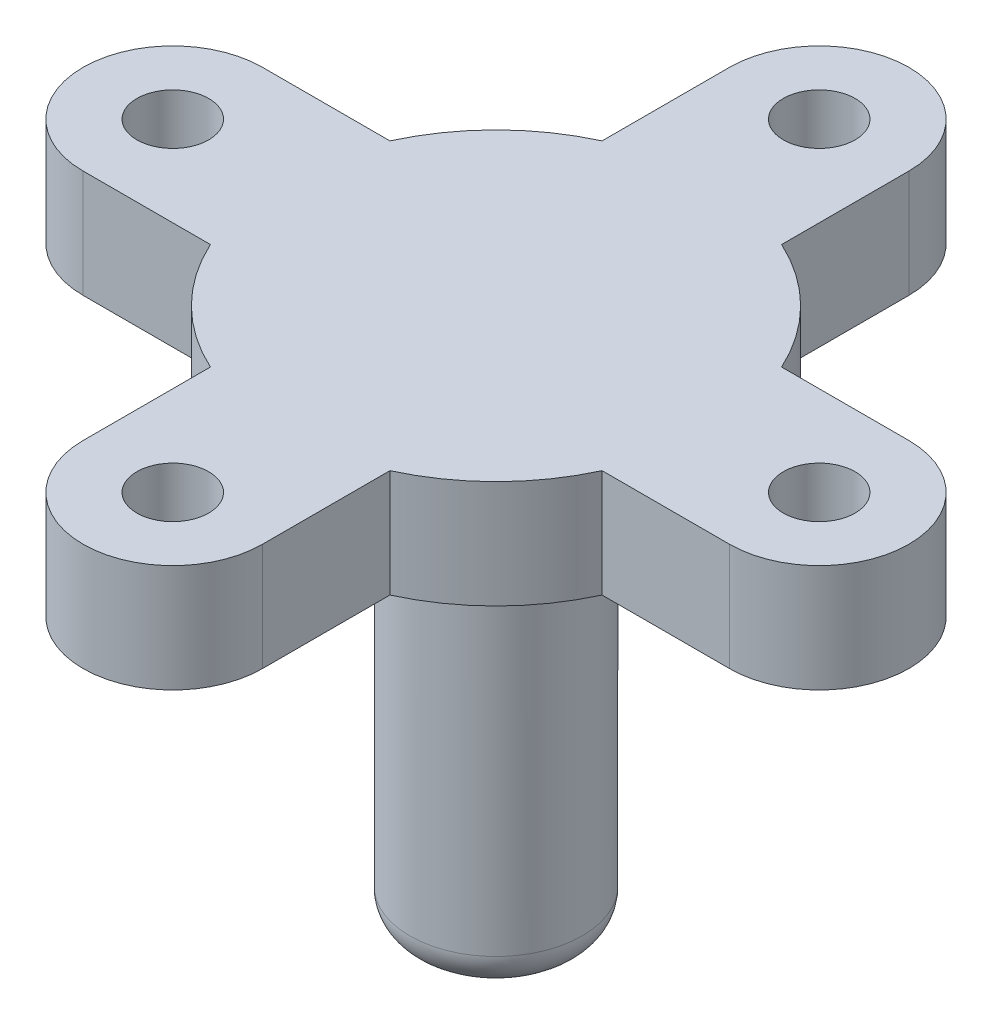
ISO-10303-21;
HEADER;
FILE_DESCRIPTION(('STEP AP214'),'2;1');
FILE_NAME('part.step','',(''),(''),'','','');
FILE_SCHEMA(('AUTOMOTIVE_DESIGN { 1 0 10303 214 1 1 1 1 }'));
ENDSEC;
DATA;
#1=APPLICATION_CONTEXT('core data for automotive mechanical design processes');
#2=APPLICATION_PROTOCOL_DEFINITION('international standard','automotive_design',2000,#1);
#3=PRODUCT_CONTEXT('',#1,'mechanical');
#4=PRODUCT('Part','Part','',(#3));
#5=PRODUCT_RELATED_PRODUCT_CATEGORY('part','',(#4));
#6=PRODUCT_DEFINITION_FORMATION('','',#4);
#7=PRODUCT_DEFINITION_CONTEXT('part definition',#1,'design');
#8=PRODUCT_DEFINITION('design','',#6,#7);
#9=PRODUCT_DEFINITION_SHAPE('','',#8);
#10=(LENGTH_UNIT() NAMED_UNIT(*) SI_UNIT(.MILLI.,.METRE.));
#11=(NAMED_UNIT(*) PLANE_ANGLE_UNIT() SI_UNIT($,.RADIAN.));
#12=(NAMED_UNIT(*) SI_UNIT($,.STERADIAN.) SOLID_ANGLE_UNIT());
#13=UNCERTAINTY_MEASURE_WITH_UNIT(LENGTH_MEASURE(1.E-05),#10,'distance_accuracy_value','');
#14=(GEOMETRIC_REPRESENTATION_CONTEXT(3) GLOBAL_UNCERTAINTY_ASSIGNED_CONTEXT((#13)) GLOBAL_UNIT_ASSIGNED_CONTEXT((#10,
#11,#12)) REPRESENTATION_CONTEXT('',''));
#15=CARTESIAN_POINT('',(0.,0.,0.));
#16=DIRECTION('',(0.,0.,1.));
#17=DIRECTION('',(1.,0.,0.));
#18=AXIS2_PLACEMENT_3D('',#15,#16,#17);
#19=CARTESIAN_POINT('',(-6.41572323944757E-08,0.645548318898728,-27.0067944363537));
#20=DIRECTION('',(0.,1.,0.));
#21=DIRECTION('',(0.,0.,1.));
#22=AXIS2_PLACEMENT_3D('',#19,#20,#21);
#23=PLANE('',#22);
#24=CARTESIAN_POINT('',(-6.4156797474945E-08,0.645548318898728,27.0067945127373));
#25=DIRECTION('',(0.,1.,0.));
#26=DIRECTION('',(0.,0.,1.));
#27=AXIS2_PLACEMENT_3D('',#24,#25,#26);
#28=CIRCLE('',#27,2.99999999999995);
#29=CARTESIAN_POINT('',(-6.4156797474945E-08,0.645548318898728,30.0067945127373));
#30=VERTEX_POINT('',#29);
#31=EDGE_CURVE('E482',#30,#30,#28,.T.);
#32=ORIENTED_EDGE('',*,*,#31,.F.);
#33=EDGE_LOOP('',(#32));
#34=FACE_BOUND('',#33,.T.);
#35=CARTESIAN_POINT('',(-6.41572323944757E-08,0.645548318898728,-27.0067944363537));
#36=DIRECTION('',(0.,1.,0.));
#37=DIRECTION('',(0.,0.,1.));
#38=AXIS2_PLACEMENT_3D('',#35,#36,#37);
#39=CIRCLE('',#38,3.);
#40=CARTESIAN_POINT('',(-6.41572323944757E-08,0.645548318898728,-24.0067944363537));
#41=VERTEX_POINT('',#40);
#42=EDGE_CURVE('E201',#41,#41,#39,.T.);
#43=ORIENTED_EDGE('',*,*,#42,.F.);
#44=EDGE_LOOP('',(#43));
#45=FACE_BOUND('',#44,.T.);
#46=CARTESIAN_POINT('',(-6.41572323944757E-08,0.645548318898728,-27.0067944363537));
#47=DIRECTION('',(0.,1.,0.));
#48=DIRECTION('',(0.,0.,1.));
#49=AXIS2_PLACEMENT_3D('',#46,#47,#48);
#50=CIRCLE('',#49,7.50000153882916);
#51=CARTESIAN_POINT('',(7.49999993584185,0.645548318898728,-27.0067944363537));
#52=VERTEX_POINT('',#51);
#53=CARTESIAN_POINT('',(-7.50000006415815,0.645548318898728,-26.9999999618077));
#54=VERTEX_POINT('',#53);
#55=EDGE_CURVE('E243',#52,#54,#50,.T.);
#56=ORIENTED_EDGE('',*,*,#55,.T.);
#57=DIRECTION('',(0.,0.,1.));
#58=VECTOR('',#57,1.);
#59=CARTESIAN_POINT('',(-7.50000006415815,0.645548318898728,-26.9999999618077));
#60=LINE('',#59,#58);
#61=CARTESIAN_POINT('',(-7.50000006415784,0.645548318898728,-16.3630681337615));
#62=VERTEX_POINT('',#61);
#63=EDGE_CURVE('E131',#54,#62,#60,.T.);
#64=ORIENTED_EDGE('',*,*,#63,.T.);
#65=CARTESIAN_POINT('',(-6.41570165883996E-08,0.645548318898728,3.81918008637733E-08));
#66=DIRECTION('',(0.,1.,0.));
#67=DIRECTION('',(0.,0.,1.));
#68=AXIS2_PLACEMENT_3D('',#65,#66,#67);
#69=CIRCLE('',#68,18.0000000000001);
#70=CARTESIAN_POINT('',(-16.3630682361112,0.645548318898728,-7.49999996180729));
#71=VERTEX_POINT('',#70);
#72=EDGE_CURVE('E407',#62,#71,#69,.T.);
#73=ORIENTED_EDGE('',*,*,#72,.T.);
#74=DIRECTION('',(-1.,0.,0.));
#75=VECTOR('',#74,1.);
#76=CARTESIAN_POINT('',(-27.0067945387026,0.645548318898728,-7.49999996180706));
#77=LINE('',#76,#75);
#78=CARTESIAN_POINT('',(-27.0067945387026,0.645548318898728,-7.50000150063715));
#79=VERTEX_POINT('',#78);
#80=EDGE_CURVE('E410',#71,#79,#77,.T.);
#81=ORIENTED_EDGE('',*,*,#80,.T.);
#82=CARTESIAN_POINT('',(-27.0067945387026,0.645548318898728,3.81920150161602E-08));
#83=DIRECTION('',(0.,1.,0.));
#84=DIRECTION('',(0.,0.,1.));
#85=AXIS2_PLACEMENT_3D('',#82,#83,#84);
#86=CIRCLE('',#85,7.50000153882916);
#87=CARTESIAN_POINT('',(-27.0000000641565,0.645548318898728,7.50000003819294));
#88=VERTEX_POINT('',#87);
#89=EDGE_CURVE('E414',#79,#88,#86,.T.);
#90=ORIENTED_EDGE('',*,*,#89,.T.);
#91=DIRECTION('',(1.,0.,0.));
#92=VECTOR('',#91,1.);
#93=CARTESIAN_POINT('',(-27.0000000641565,0.645548318898728,7.50000003819294));
#94=LINE('',#93,#92);
#95=CARTESIAN_POINT('',(-16.3630682361105,0.645548318898728,7.50000003819273));
#96=VERTEX_POINT('',#95);
#97=EDGE_CURVE('E421',#88,#96,#94,.T.);
#98=ORIENTED_EDGE('',*,*,#97,.T.);
#99=CARTESIAN_POINT('',(-6.41570165883996E-08,0.645548318898728,3.81918008637733E-08));
#100=DIRECTION('',(0.,1.,0.));
#101=DIRECTION('',(0.,0.,1.));
#102=AXIS2_PLACEMENT_3D('',#99,#100,#101);
#103=CIRCLE('',#102,18.0000000000003);
#104=CARTESIAN_POINT('',(-7.50000006415636,0.645548318898728,16.3630682101461));
#105=VERTEX_POINT('',#104);
#106=EDGE_CURVE('E424',#96,#105,#103,.T.);
#107=ORIENTED_EDGE('',*,*,#106,.T.);
#108=DIRECTION('',(0.,0.,1.));
#109=VECTOR('',#108,1.);
#110=CARTESIAN_POINT('',(-7.50000006415588,0.645548318898728,27.0067945127373));
#111=LINE('',#110,#109);
#112=CARTESIAN_POINT('',(-7.50000160298596,0.645548318898728,27.0067945127373));
#113=VERTEX_POINT('',#112);
#114=EDGE_CURVE('E427',#105,#113,#111,.T.);
#115=ORIENTED_EDGE('',*,*,#114,.T.);
#116=CARTESIAN_POINT('',(-6.4156797474945E-08,0.645548318898728,27.0067945127373));
#117=DIRECTION('',(0.,1.,0.));
#118=DIRECTION('',(0.,0.,1.));
#119=AXIS2_PLACEMENT_3D('',#116,#117,#118);
#120=CIRCLE('',#119,7.50000153882917);
#121=CARTESIAN_POINT('',(7.49999993584412,0.645548318898728,27.0000000381913));
#122=VERTEX_POINT('',#121);
#123=EDGE_CURVE('E430',#113,#122,#120,.T.);
#124=ORIENTED_EDGE('',*,*,#123,.T.);
#125=DIRECTION('',(0.,0.,-1.));
#126=VECTOR('',#125,1.);
#127=CARTESIAN_POINT('',(7.49999993584412,0.645548318898728,27.0000000381913));
#128=LINE('',#127,#126);
#129=CARTESIAN_POINT('',(7.49999993584362,0.645548318898728,16.3630682101454));
#130=VERTEX_POINT('',#129);
#131=EDGE_CURVE('E433',#122,#130,#128,.T.);
#132=ORIENTED_EDGE('',*,*,#131,.T.);
#133=CARTESIAN_POINT('',(-6.41570165883996E-08,0.645548318898728,3.81918008637733E-08));
#134=DIRECTION('',(0.,1.,0.));
#135=DIRECTION('',(0.,0.,1.));
#136=AXIS2_PLACEMENT_3D('',#133,#134,#135);
#137=CIRCLE('',#136,18.0000000000002);
#138=CARTESIAN_POINT('',(16.363068107797,0.645548318898728,7.50000003819127));
#139=VERTEX_POINT('',#138);
#140=EDGE_CURVE('E436',#130,#139,#137,.T.);
#141=ORIENTED_EDGE('',*,*,#140,.T.);
#142=DIRECTION('',(1.,0.,0.));
#143=VECTOR('',#142,1.);
#144=CARTESIAN_POINT('',(27.0067944103885,0.645548318898728,7.50000003819067));
#145=LINE('',#144,#143);
#146=CARTESIAN_POINT('',(27.0067944103885,0.645548318898728,7.50000157702075));
#147=VERTEX_POINT('',#146);
#148=EDGE_CURVE('E439',#139,#147,#145,.T.);
#149=ORIENTED_EDGE('',*,*,#148,.T.);
#150=CARTESIAN_POINT('',(27.0067944103885,0.645548318898728,3.8191583404008E-08));
#151=DIRECTION('',(0.,1.,0.));
#152=DIRECTION('',(0.,0.,1.));
#153=AXIS2_PLACEMENT_3D('',#150,#151,#152);
#154=CIRCLE('',#153,7.50000153882916);
#155=CARTESIAN_POINT('',(26.9999999358425,0.645548318898728,-7.49999996180933));
#156=VERTEX_POINT('',#155);
#157=EDGE_CURVE('E174',#147,#156,#154,.T.);
#158=ORIENTED_EDGE('',*,*,#157,.T.);
#159=DIRECTION('',(-1.,0.,0.));
#160=VECTOR('',#159,1.);
#161=CARTESIAN_POINT('',(26.9999999358425,0.645548318898728,-7.49999996180933));
#162=LINE('',#161,#160);
#163=CARTESIAN_POINT('',(16.3630681077963,0.645548318898728,-7.49999996180873));
#164=VERTEX_POINT('',#163);
#165=EDGE_CURVE('E168',#156,#164,#162,.T.);
#166=ORIENTED_EDGE('',*,*,#165,.T.);
#167=CARTESIAN_POINT('',(-6.41570165883996E-08,0.645548318898728,3.81918008637733E-08));
#168=DIRECTION('',(0.,1.,0.));
#169=DIRECTION('',(0.,0.,1.));
#170=AXIS2_PLACEMENT_3D('',#167,#168,#169);
#171=CIRCLE('',#170,18.);
#172=CARTESIAN_POINT('',(7.4999999358422,0.645548318898728,-16.3630681337621));
#173=VERTEX_POINT('',#172);
#174=EDGE_CURVE('E172',#164,#173,#171,.T.);
#175=ORIENTED_EDGE('',*,*,#174,.T.);
#176=DIRECTION('',(0.,0.,-1.));
#177=VECTOR('',#176,1.);
#178=CARTESIAN_POINT('',(7.49999993584185,0.645548318898728,-27.0067944363537));
#179=LINE('',#178,#177);
#180=EDGE_CURVE('E63',#173,#52,#179,.T.);
#181=ORIENTED_EDGE('',*,*,#180,.T.);
#182=EDGE_LOOP('',(#56,#64,#73,#81,#90,#98,#107,#115,#124,#132,#141,#149,#158,#166,#175,#181));
#183=FACE_BOUND('',#182,.T.);
#184=CARTESIAN_POINT('',(27.0067944103885,0.645548318898728,3.8191583404008E-08));
#185=DIRECTION('',(0.,1.,0.));
#186=DIRECTION('',(0.,0.,1.));
#187=AXIS2_PLACEMENT_3D('',#184,#185,#186);
#188=CIRCLE('',#187,3.);
#189=CARTESIAN_POINT('',(27.0067944103885,0.645548318898728,3.00000003819159));
#190=VERTEX_POINT('',#189);
#191=EDGE_CURVE('E474',#190,#190,#188,.T.);
#192=ORIENTED_EDGE('',*,*,#191,.F.);
#193=EDGE_LOOP('',(#192));
#194=FACE_BOUND('',#193,.T.);
#195=CARTESIAN_POINT('',(-27.0067945387026,0.645548318898728,3.81920150161602E-08));
#196=DIRECTION('',(0.,1.,0.));
#197=DIRECTION('',(0.,0.,1.));
#198=AXIS2_PLACEMENT_3D('',#195,#196,#197);
#199=CIRCLE('',#198,3.);
#200=CARTESIAN_POINT('',(-27.0067945387026,0.645548318898728,3.00000003819202));
#201=VERTEX_POINT('',#200);
#202=EDGE_CURVE('E490',#201,#201,#199,.T.);
#203=ORIENTED_EDGE('',*,*,#202,.F.);
#204=EDGE_LOOP('',(#203));
#205=FACE_BOUND('',#204,.T.);
#206=ADVANCED_FACE('F45',(#34,#45,#183,#194,#205),#23,.T.);
#207=CARTESIAN_POINT('',(-6.41572323944757E-08,-8.35445168110127,-27.0067944363537));
#208=DIRECTION('',(0.,1.,0.));
#209=DIRECTION('',(0.,0.,1.));
#210=AXIS2_PLACEMENT_3D('',#207,#208,#209);
#211=PLANE('',#210);
#212=CARTESIAN_POINT('',(-6.41570165883996E-08,-8.35445168110127,3.81918008637733E-08));
#213=DIRECTION('',(0.,1.,0.));
#214=DIRECTION('',(0.,0.,1.));
#215=AXIS2_PLACEMENT_3D('',#212,#213,#214);
#216=CIRCLE('',#215,10.2);
#217=CARTESIAN_POINT('',(-6.41570165883996E-08,-8.35445168110127,10.2000000381918));
#218=VERTEX_POINT('',#217);
#219=EDGE_CURVE('E11',#218,#218,#216,.T.);
#220=ORIENTED_EDGE('',*,*,#219,.T.);
#221=EDGE_LOOP('',(#220));
#222=FACE_BOUND('',#221,.T.);
#223=CARTESIAN_POINT('',(-6.41572323944757E-08,-8.35445168110127,-27.0067944363537));
#224=DIRECTION('',(0.,1.,0.));
#225=DIRECTION('',(0.,0.,1.));
#226=AXIS2_PLACEMENT_3D('',#223,#224,#225);
#227=CIRCLE('',#226,7.50000153882916);
#228=CARTESIAN_POINT('',(7.49999993584185,-8.35445168110127,-27.0067944363537));
#229=VERTEX_POINT('',#228);
#230=CARTESIAN_POINT('',(-7.50000006415815,-8.35445168110127,-26.9999999618077));
#231=VERTEX_POINT('',#230);
#232=EDGE_CURVE('E196',#229,#231,#227,.T.);
#233=ORIENTED_EDGE('',*,*,#232,.F.);
#234=DIRECTION('',(0.,0.,-1.));
#235=VECTOR('',#234,1.);
#236=CARTESIAN_POINT('',(7.49999993584185,-8.35445168110127,-27.0067944363537));
#237=LINE('',#236,#235);
#238=CARTESIAN_POINT('',(7.4999999358422,-8.35445168110127,-16.3630681337621));
#239=VERTEX_POINT('',#238);
#240=EDGE_CURVE('E122',#239,#229,#237,.T.);
#241=ORIENTED_EDGE('',*,*,#240,.F.);
#242=CARTESIAN_POINT('',(-6.41570165883996E-08,-8.35445168110127,3.81918008637733E-08));
#243=DIRECTION('',(0.,1.,0.));
#244=DIRECTION('',(0.,0.,1.));
#245=AXIS2_PLACEMENT_3D('',#242,#243,#244);
#246=CIRCLE('',#245,18.);
#247=CARTESIAN_POINT('',(16.3630681077963,-8.35445168110127,-7.49999996180873));
#248=VERTEX_POINT('',#247);
#249=EDGE_CURVE('E116',#248,#239,#246,.T.);
#250=ORIENTED_EDGE('',*,*,#249,.F.);
#251=DIRECTION('',(-1.,0.,0.));
#252=VECTOR('',#251,1.);
#253=CARTESIAN_POINT('',(26.9999999358425,-8.35445168110127,-7.49999996180933));
#254=LINE('',#253,#252);
#255=CARTESIAN_POINT('',(26.9999999358425,-8.35445168110127,-7.49999996180933));
#256=VERTEX_POINT('',#255);
#257=EDGE_CURVE('E183',#256,#248,#254,.T.);
#258=ORIENTED_EDGE('',*,*,#257,.F.);
#259=CARTESIAN_POINT('',(27.0067944103885,-8.35445168110127,3.8191583404008E-08));
#260=DIRECTION('',(0.,1.,0.));
#261=DIRECTION('',(0.,0.,1.));
#262=AXIS2_PLACEMENT_3D('',#259,#260,#261);
#263=CIRCLE('',#262,7.50000153882916);
#264=CARTESIAN_POINT('',(27.0067944103885,-8.35445168110127,7.50000157702075));
#265=VERTEX_POINT('',#264);
#266=EDGE_CURVE('E234',#265,#256,#263,.T.);
#267=ORIENTED_EDGE('',*,*,#266,.F.);
#268=DIRECTION('',(1.,0.,0.));
#269=VECTOR('',#268,1.);
#270=CARTESIAN_POINT('',(27.0067944103885,-8.35445168110127,7.50000003819067));
#271=LINE('',#270,#269);
#272=CARTESIAN_POINT('',(16.363068107797,-8.35445168110127,7.50000003819127));
#273=VERTEX_POINT('',#272);
#274=EDGE_CURVE('E231',#273,#265,#271,.T.);
#275=ORIENTED_EDGE('',*,*,#274,.F.);
#276=CARTESIAN_POINT('',(-6.41570165883996E-08,-8.35445168110127,3.81918008637733E-08));
#277=DIRECTION('',(0.,1.,0.));
#278=DIRECTION('',(0.,0.,1.));
#279=AXIS2_PLACEMENT_3D('',#276,#277,#278);
#280=CIRCLE('',#279,18.0000000000002);
#281=CARTESIAN_POINT('',(7.49999993584362,-8.35445168110127,16.3630682101454));
#282=VERTEX_POINT('',#281);
#283=EDGE_CURVE('E228',#282,#273,#280,.T.);
#284=ORIENTED_EDGE('',*,*,#283,.F.);
#285=DIRECTION('',(0.,0.,-1.));
#286=VECTOR('',#285,1.);
#287=CARTESIAN_POINT('',(7.49999993584412,-8.35445168110127,27.0000000381913));
#288=LINE('',#287,#286);
#289=CARTESIAN_POINT('',(7.49999993584412,-8.35445168110127,27.0000000381913));
#290=VERTEX_POINT('',#289);
#291=EDGE_CURVE('E225',#290,#282,#288,.T.);
#292=ORIENTED_EDGE('',*,*,#291,.F.);
#293=CARTESIAN_POINT('',(-6.4156797474945E-08,-8.35445168110127,27.0067945127373));
#294=DIRECTION('',(0.,1.,0.));
#295=DIRECTION('',(0.,0.,1.));
#296=AXIS2_PLACEMENT_3D('',#293,#294,#295);
#297=CIRCLE('',#296,7.50000153882917);
#298=CARTESIAN_POINT('',(-7.50000160298596,-8.35445168110127,27.0067945127373));
#299=VERTEX_POINT('',#298);
#300=EDGE_CURVE('E222',#299,#290,#297,.T.);
#301=ORIENTED_EDGE('',*,*,#300,.F.);
#302=DIRECTION('',(0.,0.,1.));
#303=VECTOR('',#302,1.);
#304=CARTESIAN_POINT('',(-7.50000006415588,-8.35445168110127,27.0067945127373));
#305=LINE('',#304,#303);
#306=CARTESIAN_POINT('',(-7.50000006415636,-8.35445168110127,16.3630682101461));
#307=VERTEX_POINT('',#306);
#308=EDGE_CURVE('E219',#307,#299,#305,.T.);
#309=ORIENTED_EDGE('',*,*,#308,.F.);
#310=CARTESIAN_POINT('',(-6.41570165883996E-08,-8.35445168110127,3.81918008637733E-08));
#311=DIRECTION('',(0.,1.,0.));
#312=DIRECTION('',(0.,0.,1.));
#313=AXIS2_PLACEMENT_3D('',#310,#311,#312);
#314=CIRCLE('',#313,18.0000000000003);
#315=CARTESIAN_POINT('',(-16.3630682361105,-8.35445168110127,7.50000003819273));
#316=VERTEX_POINT('',#315);
#317=EDGE_CURVE('E216',#316,#307,#314,.T.);
#318=ORIENTED_EDGE('',*,*,#317,.F.);
#319=DIRECTION('',(1.,0.,0.));
#320=VECTOR('',#319,1.);
#321=CARTESIAN_POINT('',(-27.0000000641565,-8.35445168110127,7.50000003819294));
#322=LINE('',#321,#320);
#323=CARTESIAN_POINT('',(-27.0000000641565,-8.35445168110127,7.50000003819294));
#324=VERTEX_POINT('',#323);
#325=EDGE_CURVE('E213',#324,#316,#322,.T.);
#326=ORIENTED_EDGE('',*,*,#325,.F.);
#327=CARTESIAN_POINT('',(-27.0067945387026,-8.35445168110127,3.81920150161602E-08));
#328=DIRECTION('',(0.,1.,0.));
#329=DIRECTION('',(0.,0.,1.));
#330=AXIS2_PLACEMENT_3D('',#327,#328,#329);
#331=CIRCLE('',#330,7.50000153882916);
#332=CARTESIAN_POINT('',(-27.0067945387026,-8.35445168110127,-7.50000150063715));
#333=VERTEX_POINT('',#332);
#334=EDGE_CURVE('E210',#333,#324,#331,.T.);
#335=ORIENTED_EDGE('',*,*,#334,.F.);
#336=DIRECTION('',(-1.,0.,0.));
#337=VECTOR('',#336,1.);
#338=CARTESIAN_POINT('',(-27.0067945387026,-8.35445168110127,-7.49999996180706));
#339=LINE('',#338,#337);
#340=CARTESIAN_POINT('',(-16.3630682361112,-8.35445168110127,-7.49999996180729));
#341=VERTEX_POINT('',#340);
#342=EDGE_CURVE('E207',#341,#333,#339,.T.);
#343=ORIENTED_EDGE('',*,*,#342,.F.);
#344=CARTESIAN_POINT('',(-6.41570165883996E-08,-8.35445168110127,3.81918008637733E-08));
#345=DIRECTION('',(0.,1.,0.));
#346=DIRECTION('',(0.,0.,1.));
#347=AXIS2_PLACEMENT_3D('',#344,#345,#346);
#348=CIRCLE('',#347,18.0000000000001);
#349=CARTESIAN_POINT('',(-7.50000006415784,-8.35445168110127,-16.3630681337615));
#350=VERTEX_POINT('',#349);
#351=EDGE_CURVE('E204',#350,#341,#348,.T.);
#352=ORIENTED_EDGE('',*,*,#351,.F.);
#353=DIRECTION('',(0.,0.,1.));
#354=VECTOR('',#353,1.);
#355=CARTESIAN_POINT('',(-7.50000006415815,-8.35445168110127,-26.9999999618077));
#356=LINE('',#355,#354);
#357=EDGE_CURVE('E200',#231,#350,#356,.T.);
#358=ORIENTED_EDGE('',*,*,#357,.F.);
#359=EDGE_LOOP('',(#233,#241,#250,#258,#267,#275,#284,#292,#301,#309,#318,#326,#335,#343,#352,#358));
#360=FACE_BOUND('',#359,.T.);
#361=CARTESIAN_POINT('',(-6.41572323944757E-08,-8.35445168110127,-27.0067944363537));
#362=DIRECTION('',(0.,1.,0.));
#363=DIRECTION('',(0.,0.,1.));
#364=AXIS2_PLACEMENT_3D('',#361,#362,#363);
#365=CIRCLE('',#364,3.);
#366=CARTESIAN_POINT('',(-6.41572323944757E-08,-8.35445168110127,-24.0067944363537));
#367=VERTEX_POINT('',#366);
#368=EDGE_CURVE('E470',#367,#367,#365,.T.);
#369=ORIENTED_EDGE('',*,*,#368,.T.);
#370=EDGE_LOOP('',(#369));
#371=FACE_BOUND('',#370,.T.);
#372=CARTESIAN_POINT('',(27.0067944103885,-8.35445168110127,3.8191583404008E-08));
#373=DIRECTION('',(0.,1.,0.));
#374=DIRECTION('',(0.,0.,1.));
#375=AXIS2_PLACEMENT_3D('',#372,#373,#374);
#376=CIRCLE('',#375,3.);
#377=CARTESIAN_POINT('',(27.0067944103885,-8.35445168110127,3.00000003819159));
#378=VERTEX_POINT('',#377);
#379=EDGE_CURVE('E478',#378,#378,#376,.T.);
#380=ORIENTED_EDGE('',*,*,#379,.T.);
#381=EDGE_LOOP('',(#380));
#382=FACE_BOUND('',#381,.T.);
#383=CARTESIAN_POINT('',(-6.4156797474945E-08,-8.35445168110127,27.0067945127373));
#384=DIRECTION('',(0.,1.,0.));
#385=DIRECTION('',(0.,0.,1.));
#386=AXIS2_PLACEMENT_3D('',#383,#384,#385);
#387=CIRCLE('',#386,2.99999999999995);
#388=CARTESIAN_POINT('',(-6.4156797474945E-08,-8.35445168110127,30.0067945127373));
#389=VERTEX_POINT('',#388);
#390=EDGE_CURVE('E486',#389,#389,#387,.T.);
#391=ORIENTED_EDGE('',*,*,#390,.T.);
#392=EDGE_LOOP('',(#391));
#393=FACE_BOUND('',#392,.T.);
#394=CARTESIAN_POINT('',(-27.0067945387026,-8.35445168110127,3.81920150161602E-08));
#395=DIRECTION('',(0.,1.,0.));
#396=DIRECTION('',(0.,0.,1.));
#397=AXIS2_PLACEMENT_3D('',#394,#395,#396);
#398=CIRCLE('',#397,3.);
#399=CARTESIAN_POINT('',(-27.0067945387026,-8.35445168110127,3.00000003819202));
#400=VERTEX_POINT('',#399);
#401=EDGE_CURVE('E494',#400,#400,#398,.T.);
#402=ORIENTED_EDGE('',*,*,#401,.T.);
#403=EDGE_LOOP('',(#402));
#404=FACE_BOUND('',#403,.T.);
#405=ADVANCED_FACE('F325',(#222,#360,#371,#382,#393,#404),#211,.F.);
#406=CARTESIAN_POINT('',(-6.41572323944757E-08,0.645548318898728,-27.0067944363537));
#407=DIRECTION('',(0.,-1.,0.));
#408=DIRECTION('',(0.,0.,-1.));
#409=AXIS2_PLACEMENT_3D('',#406,#407,#408);
#410=CYLINDRICAL_SURFACE('',#409,7.50000153882916);
#411=ORIENTED_EDGE('',*,*,#232,.T.);
#412=DIRECTION('',(0.,-1.,0.));
#413=VECTOR('',#412,1.);
#414=CARTESIAN_POINT('',(-7.50000006415815,0.645548318898728,-26.9999999618077));
#415=LINE('',#414,#413);
#416=EDGE_CURVE('E294',#54,#231,#415,.T.);
#417=ORIENTED_EDGE('',*,*,#416,.F.);
#418=ORIENTED_EDGE('',*,*,#55,.F.);
#419=DIRECTION('',(0.,-1.,0.));
#420=VECTOR('',#419,1.);
#421=CARTESIAN_POINT('',(7.49999993584185,0.645548318898728,-27.0067944363537));
#422=LINE('',#421,#420);
#423=EDGE_CURVE('E192',#52,#229,#422,.T.);
#424=ORIENTED_EDGE('',*,*,#423,.T.);
#425=EDGE_LOOP('',(#411,#417,#418,#424));
#426=FACE_BOUND('',#425,.T.);
#427=ADVANCED_FACE('F331',(#426),#410,.T.);
#428=CARTESIAN_POINT('',(-7.50000006415815,0.645548318898728,-26.9999999618077));
#429=DIRECTION('',(1.,0.,0.));
#430=DIRECTION('',(0.,0.,-1.));
#431=AXIS2_PLACEMENT_3D('',#428,#429,#430);
#432=PLANE('',#431);
#433=ORIENTED_EDGE('',*,*,#357,.T.);
#434=DIRECTION('',(0.,-1.,0.));
#435=VECTOR('',#434,1.);
#436=CARTESIAN_POINT('',(-7.50000006415784,0.645548318898728,-16.3630681337615));
#437=LINE('',#436,#435);
#438=EDGE_CURVE('E290',#62,#350,#437,.T.);
#439=ORIENTED_EDGE('',*,*,#438,.F.);
#440=ORIENTED_EDGE('',*,*,#63,.F.);
#441=ORIENTED_EDGE('',*,*,#416,.T.);
#442=EDGE_LOOP('',(#433,#439,#440,#441));
#443=FACE_BOUND('',#442,.T.);
#444=ADVANCED_FACE('F390',(#443),#432,.F.);
#445=CARTESIAN_POINT('',(-6.41570165883996E-08,0.645548318898728,3.81918008637733E-08));
#446=DIRECTION('',(0.,-1.,0.));
#447=DIRECTION('',(0.,0.,-1.));
#448=AXIS2_PLACEMENT_3D('',#445,#446,#447);
#449=CYLINDRICAL_SURFACE('',#448,18.0000000000001);
#450=ORIENTED_EDGE('',*,*,#351,.T.);
#451=DIRECTION('',(0.,-1.,0.));
#452=VECTOR('',#451,1.);
#453=CARTESIAN_POINT('',(-16.3630682361112,0.645548318898728,-7.49999996180729));
#454=LINE('',#453,#452);
#455=EDGE_CURVE('E286',#71,#341,#454,.T.);
#456=ORIENTED_EDGE('',*,*,#455,.F.);
#457=ORIENTED_EDGE('',*,*,#72,.F.);
#458=ORIENTED_EDGE('',*,*,#438,.T.);
#459=EDGE_LOOP('',(#450,#456,#457,#458));
#460=FACE_BOUND('',#459,.T.);
#461=ADVANCED_FACE('F386',(#460),#449,.T.);
#462=CARTESIAN_POINT('',(-27.0067945387026,0.645548318898728,-7.49999996180706));
#463=DIRECTION('',(0.,0.,1.));
#464=DIRECTION('',(1.,0.,0.));
#465=AXIS2_PLACEMENT_3D('',#462,#463,#464);
#466=PLANE('',#465);
#467=ORIENTED_EDGE('',*,*,#342,.T.);
#468=DIRECTION('',(0.,-1.,0.));
#469=VECTOR('',#468,1.);
#470=CARTESIAN_POINT('',(-27.0067945387026,0.645548318898728,-7.50000150063715));
#471=LINE('',#470,#469);
#472=EDGE_CURVE('E282',#79,#333,#471,.T.);
#473=ORIENTED_EDGE('',*,*,#472,.F.);
#474=ORIENTED_EDGE('',*,*,#80,.F.);
#475=ORIENTED_EDGE('',*,*,#455,.T.);
#476=EDGE_LOOP('',(#467,#473,#474,#475));
#477=FACE_BOUND('',#476,.T.);
#478=ADVANCED_FACE('F382',(#477),#466,.F.);
#479=CARTESIAN_POINT('',(-27.0067945387026,0.645548318898728,3.81920150161602E-08));
#480=DIRECTION('',(0.,-1.,0.));
#481=DIRECTION('',(0.,0.,-1.));
#482=AXIS2_PLACEMENT_3D('',#479,#480,#481);
#483=CYLINDRICAL_SURFACE('',#482,7.50000153882916);
#484=ORIENTED_EDGE('',*,*,#334,.T.);
#485=DIRECTION('',(0.,-1.,0.));
#486=VECTOR('',#485,1.);
#487=CARTESIAN_POINT('',(-27.0000000641565,0.645548318898728,7.50000003819294));
#488=LINE('',#487,#486);
#489=EDGE_CURVE('E278',#88,#324,#488,.T.);
#490=ORIENTED_EDGE('',*,*,#489,.F.);
#491=ORIENTED_EDGE('',*,*,#89,.F.);
#492=ORIENTED_EDGE('',*,*,#472,.T.);
#493=EDGE_LOOP('',(#484,#490,#491,#492));
#494=FACE_BOUND('',#493,.T.);
#495=ADVANCED_FACE('F378',(#494),#483,.T.);
#496=CARTESIAN_POINT('',(-27.0000000641565,0.645548318898728,7.50000003819294));
#497=DIRECTION('',(0.,0.,-1.));
#498=DIRECTION('',(-1.,0.,0.));
#499=AXIS2_PLACEMENT_3D('',#496,#497,#498);
#500=PLANE('',#499);
#501=ORIENTED_EDGE('',*,*,#325,.T.);
#502=DIRECTION('',(0.,-1.,0.));
#503=VECTOR('',#502,1.);
#504=CARTESIAN_POINT('',(-16.3630682361105,0.645548318898728,7.50000003819273));
#505=LINE('',#504,#503);
#506=EDGE_CURVE('E274',#96,#316,#505,.T.);
#507=ORIENTED_EDGE('',*,*,#506,.F.);
#508=ORIENTED_EDGE('',*,*,#97,.F.);
#509=ORIENTED_EDGE('',*,*,#489,.T.);
#510=EDGE_LOOP('',(#501,#507,#508,#509));
#511=FACE_BOUND('',#510,.T.);
#512=ADVANCED_FACE('F374',(#511),#500,.F.);
#513=CARTESIAN_POINT('',(-6.41570165883996E-08,0.645548318898728,3.81918008637733E-08));
#514=DIRECTION('',(0.,-1.,0.));
#515=DIRECTION('',(0.,0.,-1.));
#516=AXIS2_PLACEMENT_3D('',#513,#514,#515);
#517=CYLINDRICAL_SURFACE('',#516,18.0000000000003);
#518=ORIENTED_EDGE('',*,*,#317,.T.);
#519=DIRECTION('',(0.,-1.,0.));
#520=VECTOR('',#519,1.);
#521=CARTESIAN_POINT('',(-7.50000006415636,0.645548318898728,16.3630682101461));
#522=LINE('',#521,#520);
#523=EDGE_CURVE('E270',#105,#307,#522,.T.);
#524=ORIENTED_EDGE('',*,*,#523,.F.);
#525=ORIENTED_EDGE('',*,*,#106,.F.);
#526=ORIENTED_EDGE('',*,*,#506,.T.);
#527=EDGE_LOOP('',(#518,#524,#525,#526));
#528=FACE_BOUND('',#527,.T.);
#529=ADVANCED_FACE('F370',(#528),#517,.T.);
#530=CARTESIAN_POINT('',(-7.50000006415588,0.645548318898728,27.0067945127373));
#531=DIRECTION('',(1.,0.,0.));
#532=DIRECTION('',(0.,0.,-1.));
#533=AXIS2_PLACEMENT_3D('',#530,#531,#532);
#534=PLANE('',#533);
#535=ORIENTED_EDGE('',*,*,#308,.T.);
#536=DIRECTION('',(0.,-1.,0.));
#537=VECTOR('',#536,1.);
#538=CARTESIAN_POINT('',(-7.50000160298596,0.645548318898728,27.0067945127373));
#539=LINE('',#538,#537);
#540=EDGE_CURVE('E266',#113,#299,#539,.T.);
#541=ORIENTED_EDGE('',*,*,#540,.F.);
#542=ORIENTED_EDGE('',*,*,#114,.F.);
#543=ORIENTED_EDGE('',*,*,#523,.T.);
#544=EDGE_LOOP('',(#535,#541,#542,#543));
#545=FACE_BOUND('',#544,.T.);
#546=ADVANCED_FACE('F366',(#545),#534,.F.);
#547=CARTESIAN_POINT('',(-6.4156797474945E-08,0.645548318898728,27.0067945127373));
#548=DIRECTION('',(0.,-1.,0.));
#549=DIRECTION('',(0.,0.,-1.));
#550=AXIS2_PLACEMENT_3D('',#547,#548,#549);
#551=CYLINDRICAL_SURFACE('',#550,7.50000153882917);
#552=ORIENTED_EDGE('',*,*,#300,.T.);
#553=DIRECTION('',(0.,-1.,0.));
#554=VECTOR('',#553,1.);
#555=CARTESIAN_POINT('',(7.49999993584412,0.645548318898728,27.0000000381913));
#556=LINE('',#555,#554);
#557=EDGE_CURVE('E262',#122,#290,#556,.T.);
#558=ORIENTED_EDGE('',*,*,#557,.F.);
#559=ORIENTED_EDGE('',*,*,#123,.F.);
#560=ORIENTED_EDGE('',*,*,#540,.T.);
#561=EDGE_LOOP('',(#552,#558,#559,#560));
#562=FACE_BOUND('',#561,.T.);
#563=ADVANCED_FACE('F362',(#562),#551,.T.);
#564=CARTESIAN_POINT('',(7.49999993584412,0.645548318898728,27.0000000381913));
#565=DIRECTION('',(-1.,0.,0.));
#566=DIRECTION('',(0.,0.,1.));
#567=AXIS2_PLACEMENT_3D('',#564,#565,#566);
#568=PLANE('',#567);
#569=ORIENTED_EDGE('',*,*,#291,.T.);
#570=DIRECTION('',(0.,-1.,0.));
#571=VECTOR('',#570,1.);
#572=CARTESIAN_POINT('',(7.49999993584362,0.645548318898728,16.3630682101454));
#573=LINE('',#572,#571);
#574=EDGE_CURVE('E258',#130,#282,#573,.T.);
#575=ORIENTED_EDGE('',*,*,#574,.F.);
#576=ORIENTED_EDGE('',*,*,#131,.F.);
#577=ORIENTED_EDGE('',*,*,#557,.T.);
#578=EDGE_LOOP('',(#569,#575,#576,#577));
#579=FACE_BOUND('',#578,.T.);
#580=ADVANCED_FACE('F358',(#579),#568,.F.);
#581=CARTESIAN_POINT('',(-6.41570165883996E-08,0.645548318898728,3.81918008637733E-08));
#582=DIRECTION('',(0.,-1.,0.));
#583=DIRECTION('',(0.,0.,-1.));
#584=AXIS2_PLACEMENT_3D('',#581,#582,#583);
#585=CYLINDRICAL_SURFACE('',#584,18.0000000000002);
#586=ORIENTED_EDGE('',*,*,#283,.T.);
#587=DIRECTION('',(0.,-1.,0.));
#588=VECTOR('',#587,1.);
#589=CARTESIAN_POINT('',(16.363068107797,0.645548318898728,7.50000003819127));
#590=LINE('',#589,#588);
#591=EDGE_CURVE('E254',#139,#273,#590,.T.);
#592=ORIENTED_EDGE('',*,*,#591,.F.);
#593=ORIENTED_EDGE('',*,*,#140,.F.);
#594=ORIENTED_EDGE('',*,*,#574,.T.);
#595=EDGE_LOOP('',(#586,#592,#593,#594));
#596=FACE_BOUND('',#595,.T.);
#597=ADVANCED_FACE('F354',(#596),#585,.T.);
#598=CARTESIAN_POINT('',(27.0067944103885,0.645548318898728,7.50000003819067));
#599=DIRECTION('',(0.,0.,-1.));
#600=DIRECTION('',(-1.,0.,0.));
#601=AXIS2_PLACEMENT_3D('',#598,#599,#600);
#602=PLANE('',#601);
#603=ORIENTED_EDGE('',*,*,#274,.T.);
#604=DIRECTION('',(0.,-1.,0.));
#605=VECTOR('',#604,1.);
#606=CARTESIAN_POINT('',(27.0067944103885,0.645548318898728,7.50000157702075));
#607=LINE('',#606,#605);
#608=EDGE_CURVE('E250',#147,#265,#607,.T.);
#609=ORIENTED_EDGE('',*,*,#608,.F.);
#610=ORIENTED_EDGE('',*,*,#148,.F.);
#611=ORIENTED_EDGE('',*,*,#591,.T.);
#612=EDGE_LOOP('',(#603,#609,#610,#611));
#613=FACE_BOUND('',#612,.T.);
#614=ADVANCED_FACE('F350',(#613),#602,.F.);
#615=CARTESIAN_POINT('',(27.0067944103885,0.645548318898728,3.8191583404008E-08));
#616=DIRECTION('',(0.,-1.,0.));
#617=DIRECTION('',(0.,0.,-1.));
#618=AXIS2_PLACEMENT_3D('',#615,#616,#617);
#619=CYLINDRICAL_SURFACE('',#618,7.50000153882916);
#620=ORIENTED_EDGE('',*,*,#266,.T.);
#621=DIRECTION('',(0.,-1.,0.));
#622=VECTOR('',#621,1.);
#623=CARTESIAN_POINT('',(26.9999999358425,0.645548318898728,-7.49999996180933));
#624=LINE('',#623,#622);
#625=EDGE_CURVE('E185',#156,#256,#624,.T.);
#626=ORIENTED_EDGE('',*,*,#625,.F.);
#627=ORIENTED_EDGE('',*,*,#157,.F.);
#628=ORIENTED_EDGE('',*,*,#608,.T.);
#629=EDGE_LOOP('',(#620,#626,#627,#628));
#630=FACE_BOUND('',#629,.T.);
#631=ADVANCED_FACE('F347',(#630),#619,.T.);
#632=CARTESIAN_POINT('',(26.9999999358425,0.645548318898728,-7.49999996180933));
#633=DIRECTION('',(0.,0.,1.));
#634=DIRECTION('',(1.,0.,0.));
#635=AXIS2_PLACEMENT_3D('',#632,#633,#634);
#636=PLANE('',#635);
#637=ORIENTED_EDGE('',*,*,#257,.T.);
#638=DIRECTION('',(0.,-1.,0.));
#639=VECTOR('',#638,1.);
#640=CARTESIAN_POINT('',(16.3630681077963,0.645548318898728,-7.49999996180873));
#641=LINE('',#640,#639);
#642=EDGE_CURVE('E180',#164,#248,#641,.T.);
#643=ORIENTED_EDGE('',*,*,#642,.F.);
#644=ORIENTED_EDGE('',*,*,#165,.F.);
#645=ORIENTED_EDGE('',*,*,#625,.T.);
#646=EDGE_LOOP('',(#637,#643,#644,#645));
#647=FACE_BOUND('',#646,.T.);
#648=ADVANCED_FACE('F181',(#647),#636,.F.);
#649=CARTESIAN_POINT('',(-6.41570165883996E-08,0.645548318898728,3.81918008637733E-08));
#650=DIRECTION('',(0.,-1.,0.));
#651=DIRECTION('',(0.,0.,-1.));
#652=AXIS2_PLACEMENT_3D('',#649,#650,#651);
#653=CYLINDRICAL_SURFACE('',#652,18.);
#654=ORIENTED_EDGE('',*,*,#249,.T.);
#655=DIRECTION('',(0.,-1.,0.));
#656=VECTOR('',#655,1.);
#657=CARTESIAN_POINT('',(7.4999999358422,0.645548318898728,-16.3630681337621));
#658=LINE('',#657,#656);
#659=EDGE_CURVE('E186',#173,#239,#658,.T.);
#660=ORIENTED_EDGE('',*,*,#659,.F.);
#661=ORIENTED_EDGE('',*,*,#174,.F.);
#662=ORIENTED_EDGE('',*,*,#642,.T.);
#663=EDGE_LOOP('',(#654,#660,#661,#662));
#664=FACE_BOUND('',#663,.T.);
#665=ADVANCED_FACE('F188',(#664),#653,.T.);
#666=CARTESIAN_POINT('',(7.49999993584185,0.645548318898728,-27.0067944363537));
#667=DIRECTION('',(-1.,0.,0.));
#668=DIRECTION('',(0.,0.,1.));
#669=AXIS2_PLACEMENT_3D('',#666,#667,#668);
#670=PLANE('',#669);
#671=ORIENTED_EDGE('',*,*,#240,.T.);
#672=ORIENTED_EDGE('',*,*,#423,.F.);
#673=ORIENTED_EDGE('',*,*,#180,.F.);
#674=ORIENTED_EDGE('',*,*,#659,.T.);
#675=EDGE_LOOP('',(#671,#672,#673,#674));
#676=FACE_BOUND('',#675,.T.);
#677=ADVANCED_FACE('F340',(#676),#670,.F.);
#678=CARTESIAN_POINT('',(-6.41572323944757E-08,0.645548318898728,-27.0067944363537));
#679=DIRECTION('',(0.,-1.,0.));
#680=DIRECTION('',(0.,0.,-1.));
#681=AXIS2_PLACEMENT_3D('',#678,#679,#680);
#682=CYLINDRICAL_SURFACE('',#681,3.);
#683=ORIENTED_EDGE('',*,*,#42,.T.);
#684=EDGE_LOOP('',(#683));
#685=FACE_BOUND('',#684,.T.);
#686=ORIENTED_EDGE('',*,*,#368,.F.);
#687=EDGE_LOOP('',(#686));
#688=FACE_BOUND('',#687,.T.);
#689=ADVANCED_FACE('F337',(#685,#688),#682,.F.);
#690=CARTESIAN_POINT('',(27.0067944103885,0.645548318898728,3.8191583404008E-08));
#691=DIRECTION('',(0.,-1.,0.));
#692=DIRECTION('',(0.,0.,-1.));
#693=AXIS2_PLACEMENT_3D('',#690,#691,#692);
#694=CYLINDRICAL_SURFACE('',#693,3.);
#695=ORIENTED_EDGE('',*,*,#191,.T.);
#696=EDGE_LOOP('',(#695));
#697=FACE_BOUND('',#696,.T.);
#698=ORIENTED_EDGE('',*,*,#379,.F.);
#699=EDGE_LOOP('',(#698));
#700=FACE_BOUND('',#699,.T.);
#701=ADVANCED_FACE('F512',(#697,#700),#694,.F.);
#702=CARTESIAN_POINT('',(-6.4156797474945E-08,0.645548318898728,27.0067945127373));
#703=DIRECTION('',(0.,-1.,0.));
#704=DIRECTION('',(0.,0.,-1.));
#705=AXIS2_PLACEMENT_3D('',#702,#703,#704);
#706=CYLINDRICAL_SURFACE('',#705,2.99999999999995);
#707=ORIENTED_EDGE('',*,*,#31,.T.);
#708=EDGE_LOOP('',(#707));
#709=FACE_BOUND('',#708,.T.);
#710=ORIENTED_EDGE('',*,*,#390,.F.);
#711=EDGE_LOOP('',(#710));
#712=FACE_BOUND('',#711,.T.);
#713=ADVANCED_FACE('F505',(#709,#712),#706,.F.);
#714=CARTESIAN_POINT('',(-27.0067945387026,0.645548318898728,3.81920150161602E-08));
#715=DIRECTION('',(0.,-1.,0.));
#716=DIRECTION('',(0.,0.,-1.));
#717=AXIS2_PLACEMENT_3D('',#714,#715,#716);
#718=CYLINDRICAL_SURFACE('',#717,3.);
#719=ORIENTED_EDGE('',*,*,#202,.T.);
#720=EDGE_LOOP('',(#719));
#721=FACE_BOUND('',#720,.T.);
#722=ORIENTED_EDGE('',*,*,#401,.F.);
#723=EDGE_LOOP('',(#722));
#724=FACE_BOUND('',#723,.T.);
#725=ADVANCED_FACE('F322',(#721,#724),#718,.F.);
#726=CARTESIAN_POINT('',(-6.41570165883996E-08,-44.3544516811013,3.81918008637733E-08));
#727=DIRECTION('',(0.,1.,0.));
#728=DIRECTION('',(0.,0.,1.));
#729=AXIS2_PLACEMENT_3D('',#726,#727,#728);
#730=CYLINDRICAL_SURFACE('',#729,7.2);
#731=CARTESIAN_POINT('',(-6.41570165883996E-08,-41.3544516811013,3.81918008637733E-08));
#732=DIRECTION('',(0.,-1.,0.));
#733=DIRECTION('',(0.,0.,-1.));
#734=AXIS2_PLACEMENT_3D('',#731,#732,#733);
#735=CIRCLE('',#734,7.2);
#736=CARTESIAN_POINT('',(-6.41570165883996E-08,-41.3544516811013,-7.1999999618082));
#737=VERTEX_POINT('',#736);
#738=EDGE_CURVE('E55',#737,#737,#735,.F.);
#739=ORIENTED_EDGE('',*,*,#738,.T.);
#740=EDGE_LOOP('',(#739));
#741=FACE_BOUND('',#740,.T.);
#742=CARTESIAN_POINT('',(-6.41570165883996E-08,-11.3544516811013,3.81918008637733E-08));
#743=DIRECTION('',(0.,1.,0.));
#744=DIRECTION('',(0.,0.,1.));
#745=AXIS2_PLACEMENT_3D('',#742,#743,#744);
#746=CIRCLE('',#745,7.2);
#747=CARTESIAN_POINT('',(-6.41570165883996E-08,-11.3544516811013,7.2000000381918));
#748=VERTEX_POINT('',#747);
#749=EDGE_CURVE('E301',#748,#748,#746,.F.);
#750=ORIENTED_EDGE('',*,*,#749,.T.);
#751=EDGE_LOOP('',(#750));
#752=FACE_BOUND('',#751,.T.);
#753=ADVANCED_FACE('F308',(#741,#752),#730,.T.);
#754=CARTESIAN_POINT('',(-6.41570165883996E-08,-44.3544516811013,3.81918008637733E-08));
#755=DIRECTION('',(0.,-1.,0.));
#756=DIRECTION('',(0.,0.,-1.));
#757=AXIS2_PLACEMENT_3D('',#754,#755,#756);
#758=PLANE('',#757);
#759=CARTESIAN_POINT('',(-6.41570165883996E-08,-44.3544516811013,3.81918008637733E-08));
#760=DIRECTION('',(0.,-1.,0.));
#761=DIRECTION('',(0.,0.,-1.));
#762=AXIS2_PLACEMENT_3D('',#759,#760,#761);
#763=CIRCLE('',#762,4.2);
#764=CARTESIAN_POINT('',(-6.41570165883996E-08,-44.3544516811013,-4.1999999618082));
#765=VERTEX_POINT('',#764);
#766=EDGE_CURVE('E297',#765,#765,#763,.T.);
#767=ORIENTED_EDGE('',*,*,#766,.T.);
#768=EDGE_LOOP('',(#767));
#769=FACE_BOUND('',#768,.T.);
#770=ADVANCED_FACE('F314',(#769),#758,.T.);
#771=CARTESIAN_POINT('',(-6.41570165883996E-08,-41.3544516811013,3.81918008637733E-08));
#772=DIRECTION('',(0.,-1.,0.));
#773=DIRECTION('',(0.,0.,-1.));
#774=AXIS2_PLACEMENT_3D('',#771,#772,#773);
#775=TOROIDAL_SURFACE('',#774,4.2,3.);
#776=ORIENTED_EDGE('',*,*,#738,.F.);
#777=EDGE_LOOP('',(#776));
#778=FACE_BOUND('',#777,.T.);
#779=ORIENTED_EDGE('',*,*,#766,.F.);
#780=EDGE_LOOP('',(#779));
#781=FACE_BOUND('',#780,.T.);
#782=ADVANCED_FACE('F311',(#778,#781),#775,.T.);
#783=CARTESIAN_POINT('',(-6.41570165883996E-08,-11.3544516811013,3.81918008637733E-08));
#784=DIRECTION('',(0.,1.,0.));
#785=DIRECTION('',(0.,0.,1.));
#786=AXIS2_PLACEMENT_3D('',#783,#784,#785);
#787=TOROIDAL_SURFACE('',#786,10.2,3.);
#788=ORIENTED_EDGE('',*,*,#219,.F.);
#789=EDGE_LOOP('',(#788));
#790=FACE_BOUND('',#789,.T.);
#791=ORIENTED_EDGE('',*,*,#749,.F.);
#792=EDGE_LOOP('',(#791));
#793=FACE_BOUND('',#792,.T.);
#794=ADVANCED_FACE('F47',(#790,#793),#787,.F.);
#795=CLOSED_SHELL('',(#206,#405,#427,#444,#461,#478,#495,#512,#529,#546,#563,#580,#597,#614,
#631,#648,#665,#677,#689,#701,#713,#725,#753,#770,#782,#794));
#796=MANIFOLD_SOLID_BREP('B2',#795);
#797=ADVANCED_BREP_SHAPE_REPRESENTATION('',(#18,#796),#14);
#798=SHAPE_DEFINITION_REPRESENTATION(#9,#797);
ENDSEC;
END-ISO-10303-21;
